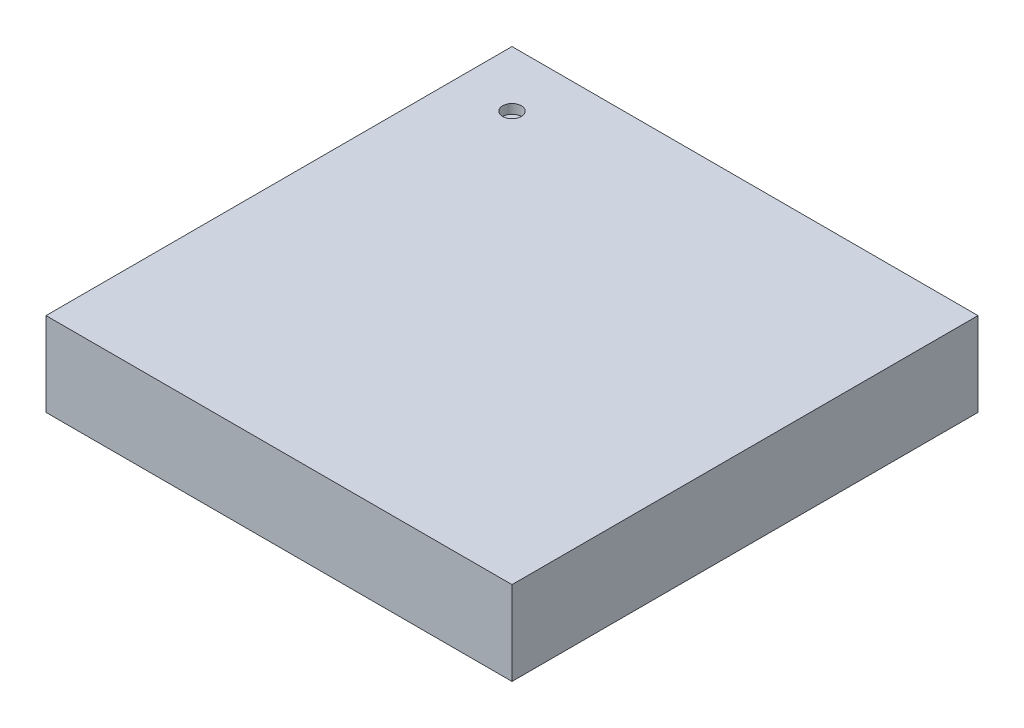
ISO-10303-21;
HEADER;
FILE_DESCRIPTION(('STEP AP214'),'2;1');
FILE_NAME('part.step','',(''),(''),'','','');
FILE_SCHEMA(('AUTOMOTIVE_DESIGN { 1 0 10303 214 1 1 1 1 }'));
ENDSEC;
DATA;
#1=APPLICATION_CONTEXT('core data for automotive mechanical design processes');
#2=APPLICATION_PROTOCOL_DEFINITION('international standard','automotive_design',2000,#1);
#3=PRODUCT_CONTEXT('',#1,'mechanical');
#4=PRODUCT('Part','Part','',(#3));
#5=PRODUCT_RELATED_PRODUCT_CATEGORY('part','',(#4));
#6=PRODUCT_DEFINITION_FORMATION('','',#4);
#7=PRODUCT_DEFINITION_CONTEXT('part definition',#1,'design');
#8=PRODUCT_DEFINITION('design','',#6,#7);
#9=PRODUCT_DEFINITION_SHAPE('','',#8);
#10=(LENGTH_UNIT() NAMED_UNIT(*) SI_UNIT(.MILLI.,.METRE.));
#11=(NAMED_UNIT(*) PLANE_ANGLE_UNIT() SI_UNIT($,.RADIAN.));
#12=(NAMED_UNIT(*) SI_UNIT($,.STERADIAN.) SOLID_ANGLE_UNIT());
#13=UNCERTAINTY_MEASURE_WITH_UNIT(LENGTH_MEASURE(1.E-05),#10,'distance_accuracy_value','');
#14=(GEOMETRIC_REPRESENTATION_CONTEXT(3) GLOBAL_UNCERTAINTY_ASSIGNED_CONTEXT((#13)) GLOBAL_UNIT_ASSIGNED_CONTEXT((#10,
#11,#12)) REPRESENTATION_CONTEXT('',''));
#15=CARTESIAN_POINT('',(0.,0.,0.));
#16=DIRECTION('',(0.,0.,1.));
#17=DIRECTION('',(1.,0.,0.));
#18=AXIS2_PLACEMENT_3D('',#15,#16,#17);
#19=CARTESIAN_POINT('',(0.,0.9,0.));
#20=DIRECTION('',(1.,0.,0.));
#21=DIRECTION('',(0.,0.,-1.));
#22=AXIS2_PLACEMENT_3D('',#19,#20,#21);
#23=PLANE('',#22);
#24=DIRECTION('',(0.,0.,1.));
#25=VECTOR('',#24,1.);
#26=CARTESIAN_POINT('',(0.,0.,0.));
#27=LINE('',#26,#25);
#28=CARTESIAN_POINT('',(0.,0.,-5.));
#29=VERTEX_POINT('',#28);
#30=CARTESIAN_POINT('',(0.,0.,0.));
#31=VERTEX_POINT('',#30);
#32=EDGE_CURVE('E97',#29,#31,#27,.T.);
#33=ORIENTED_EDGE('',*,*,#32,.T.);
#34=DIRECTION('',(0.,-1.,0.));
#35=VECTOR('',#34,1.);
#36=CARTESIAN_POINT('',(0.,0.9,0.));
#37=LINE('',#36,#35);
#38=CARTESIAN_POINT('',(0.,0.9,0.));
#39=VERTEX_POINT('',#38);
#40=EDGE_CURVE('E11',#39,#31,#37,.T.);
#41=ORIENTED_EDGE('',*,*,#40,.F.);
#42=DIRECTION('',(0.,0.,1.));
#43=VECTOR('',#42,1.);
#44=CARTESIAN_POINT('',(0.,0.9,0.));
#45=LINE('',#44,#43);
#46=CARTESIAN_POINT('',(0.,0.9,-5.));
#47=VERTEX_POINT('',#46);
#48=EDGE_CURVE('E85',#47,#39,#45,.T.);
#49=ORIENTED_EDGE('',*,*,#48,.F.);
#50=DIRECTION('',(0.,-1.,0.));
#51=VECTOR('',#50,1.);
#52=CARTESIAN_POINT('',(0.,0.9,-5.));
#53=LINE('',#52,#51);
#54=EDGE_CURVE('E93',#47,#29,#53,.T.);
#55=ORIENTED_EDGE('',*,*,#54,.T.);
#56=EDGE_LOOP('',(#33,#41,#49,#55));
#57=FACE_BOUND('',#56,.T.);
#58=ADVANCED_FACE('F34',(#57),#23,.F.);
#59=CARTESIAN_POINT('',(0.,0.9,0.));
#60=DIRECTION('',(0.,0.,-1.));
#61=DIRECTION('',(-1.,0.,0.));
#62=AXIS2_PLACEMENT_3D('',#59,#60,#61);
#63=PLANE('',#62);
#64=DIRECTION('',(1.,0.,0.));
#65=VECTOR('',#64,1.);
#66=CARTESIAN_POINT('',(0.,0.,0.));
#67=LINE('',#66,#65);
#68=CARTESIAN_POINT('',(5.,0.,0.));
#69=VERTEX_POINT('',#68);
#70=EDGE_CURVE('E89',#31,#69,#67,.T.);
#71=ORIENTED_EDGE('',*,*,#70,.T.);
#72=DIRECTION('',(0.,-1.,0.));
#73=VECTOR('',#72,1.);
#74=CARTESIAN_POINT('',(5.,0.9,0.));
#75=LINE('',#74,#73);
#76=CARTESIAN_POINT('',(5.,0.9,0.));
#77=VERTEX_POINT('',#76);
#78=EDGE_CURVE('E42',#77,#69,#75,.T.);
#79=ORIENTED_EDGE('',*,*,#78,.F.);
#80=DIRECTION('',(1.,0.,0.));
#81=VECTOR('',#80,1.);
#82=CARTESIAN_POINT('',(0.,0.9,0.));
#83=LINE('',#82,#81);
#84=EDGE_CURVE('E80',#39,#77,#83,.T.);
#85=ORIENTED_EDGE('',*,*,#84,.F.);
#86=ORIENTED_EDGE('',*,*,#40,.T.);
#87=EDGE_LOOP('',(#71,#79,#85,#86));
#88=FACE_BOUND('',#87,.T.);
#89=ADVANCED_FACE('F88',(#88),#63,.F.);
#90=CARTESIAN_POINT('',(5.,0.9,0.));
#91=DIRECTION('',(-1.,0.,0.));
#92=DIRECTION('',(0.,0.,1.));
#93=AXIS2_PLACEMENT_3D('',#90,#91,#92);
#94=PLANE('',#93);
#95=DIRECTION('',(0.,0.,-1.));
#96=VECTOR('',#95,1.);
#97=CARTESIAN_POINT('',(5.,0.,0.));
#98=LINE('',#97,#96);
#99=CARTESIAN_POINT('',(5.,0.,-5.));
#100=VERTEX_POINT('',#99);
#101=EDGE_CURVE('E67',#69,#100,#98,.T.);
#102=ORIENTED_EDGE('',*,*,#101,.T.);
#103=DIRECTION('',(0.,-1.,0.));
#104=VECTOR('',#103,1.);
#105=CARTESIAN_POINT('',(5.,0.9,-5.));
#106=LINE('',#105,#104);
#107=CARTESIAN_POINT('',(5.,0.9,-5.));
#108=VERTEX_POINT('',#107);
#109=EDGE_CURVE('E90',#108,#100,#106,.T.);
#110=ORIENTED_EDGE('',*,*,#109,.F.);
#111=DIRECTION('',(0.,0.,-1.));
#112=VECTOR('',#111,1.);
#113=CARTESIAN_POINT('',(5.,0.9,0.));
#114=LINE('',#113,#112);
#115=EDGE_CURVE('E83',#77,#108,#114,.T.);
#116=ORIENTED_EDGE('',*,*,#115,.F.);
#117=ORIENTED_EDGE('',*,*,#78,.T.);
#118=EDGE_LOOP('',(#102,#110,#116,#117));
#119=FACE_BOUND('',#118,.T.);
#120=ADVANCED_FACE('F91',(#119),#94,.F.);
#121=CARTESIAN_POINT('',(0.,0.9,-5.));
#122=DIRECTION('',(0.,0.,1.));
#123=DIRECTION('',(1.,0.,0.));
#124=AXIS2_PLACEMENT_3D('',#121,#122,#123);
#125=PLANE('',#124);
#126=DIRECTION('',(-1.,0.,0.));
#127=VECTOR('',#126,1.);
#128=CARTESIAN_POINT('',(0.,0.,-5.));
#129=LINE('',#128,#127);
#130=EDGE_CURVE('E73',#100,#29,#129,.T.);
#131=ORIENTED_EDGE('',*,*,#130,.T.);
#132=ORIENTED_EDGE('',*,*,#54,.F.);
#133=DIRECTION('',(-1.,0.,0.));
#134=VECTOR('',#133,1.);
#135=CARTESIAN_POINT('',(0.,0.9,-5.));
#136=LINE('',#135,#134);
#137=EDGE_CURVE('E50',#108,#47,#136,.T.);
#138=ORIENTED_EDGE('',*,*,#137,.F.);
#139=ORIENTED_EDGE('',*,*,#109,.T.);
#140=EDGE_LOOP('',(#131,#132,#138,#139));
#141=FACE_BOUND('',#140,.T.);
#142=ADVANCED_FACE('F105',(#141),#125,.F.);
#143=CARTESIAN_POINT('',(0.,0.9,0.));
#144=DIRECTION('',(0.,-1.,0.));
#145=DIRECTION('',(0.,0.,-1.));
#146=AXIS2_PLACEMENT_3D('',#143,#144,#145);
#147=PLANE('',#146);
#148=CARTESIAN_POINT('',(0.6,0.9,-4.4));
#149=DIRECTION('',(0.,1.,0.));
#150=DIRECTION('',(0.,0.,1.));
#151=AXIS2_PLACEMENT_3D('',#148,#149,#150);
#152=CIRCLE('',#151,0.1);
#153=CARTESIAN_POINT('',(0.6,0.9,-4.3));
#154=VERTEX_POINT('',#153);
#155=EDGE_CURVE('E111',#154,#154,#152,.T.);
#156=ORIENTED_EDGE('',*,*,#155,.F.);
#157=EDGE_LOOP('',(#156));
#158=FACE_BOUND('',#157,.T.);
#159=ORIENTED_EDGE('',*,*,#48,.T.);
#160=ORIENTED_EDGE('',*,*,#84,.T.);
#161=ORIENTED_EDGE('',*,*,#115,.T.);
#162=ORIENTED_EDGE('',*,*,#137,.T.);
#163=EDGE_LOOP('',(#159,#160,#161,#162));
#164=FACE_BOUND('',#163,.T.);
#165=ADVANCED_FACE('F81',(#158,#164),#147,.F.);
#166=CARTESIAN_POINT('',(0.,0.,0.));
#167=DIRECTION('',(0.,-1.,0.));
#168=DIRECTION('',(0.,0.,-1.));
#169=AXIS2_PLACEMENT_3D('',#166,#167,#168);
#170=PLANE('',#169);
#171=ORIENTED_EDGE('',*,*,#32,.F.);
#172=ORIENTED_EDGE('',*,*,#130,.F.);
#173=ORIENTED_EDGE('',*,*,#101,.F.);
#174=ORIENTED_EDGE('',*,*,#70,.F.);
#175=EDGE_LOOP('',(#171,#172,#173,#174));
#176=FACE_BOUND('',#175,.T.);
#177=ADVANCED_FACE('F108',(#176),#170,.T.);
#178=CARTESIAN_POINT('',(0.6,0.8,-4.4));
#179=DIRECTION('',(0.,1.,0.));
#180=DIRECTION('',(0.,0.,1.));
#181=AXIS2_PLACEMENT_3D('',#178,#179,#180);
#182=CYLINDRICAL_SURFACE('',#181,0.1);
#183=CARTESIAN_POINT('',(0.6,0.8,-4.4));
#184=DIRECTION('',(0.,1.,0.));
#185=DIRECTION('',(0.,0.,1.));
#186=AXIS2_PLACEMENT_3D('',#183,#184,#185);
#187=CIRCLE('',#186,0.1);
#188=CARTESIAN_POINT('',(0.6,0.8,-4.3));
#189=VERTEX_POINT('',#188);
#190=EDGE_CURVE('E100',#189,#189,#187,.T.);
#191=ORIENTED_EDGE('',*,*,#190,.F.);
#192=EDGE_LOOP('',(#191));
#193=FACE_BOUND('',#192,.T.);
#194=ORIENTED_EDGE('',*,*,#155,.T.);
#195=EDGE_LOOP('',(#194));
#196=FACE_BOUND('',#195,.T.);
#197=ADVANCED_FACE('F119',(#193,#196),#182,.F.);
#198=CARTESIAN_POINT('',(0.6,0.8,-4.4));
#199=DIRECTION('',(0.,1.,0.));
#200=DIRECTION('',(0.,0.,1.));
#201=AXIS2_PLACEMENT_3D('',#198,#199,#200);
#202=PLANE('',#201);
#203=ORIENTED_EDGE('',*,*,#190,.T.);
#204=EDGE_LOOP('',(#203));
#205=FACE_BOUND('',#204,.T.);
#206=ADVANCED_FACE('F117',(#205),#202,.T.);
#207=CLOSED_SHELL('',(#58,#89,#120,#142,#165,#177,#197,#206));
#208=MANIFOLD_SOLID_BREP('B2',#207);
#209=ADVANCED_BREP_SHAPE_REPRESENTATION('',(#18,#208),#14);
#210=SHAPE_DEFINITION_REPRESENTATION(#9,#209);
ENDSEC;
END-ISO-10303-21;
